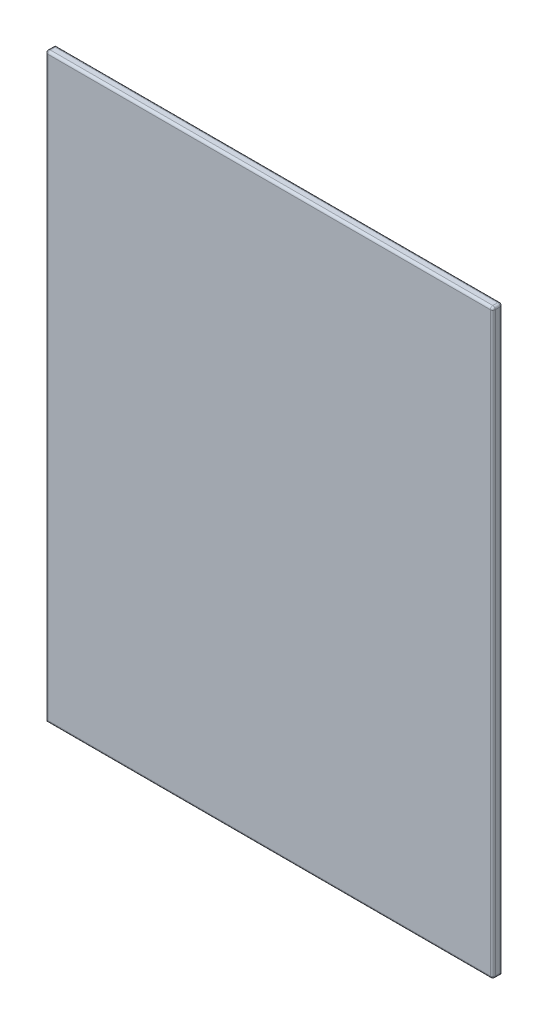
ISO-10303-21;
HEADER;
FILE_DESCRIPTION(('STEP AP214'),'2;1');
FILE_NAME('part.step','',(''),(''),'','','');
FILE_SCHEMA(('AUTOMOTIVE_DESIGN { 1 0 10303 214 1 1 1 1 }'));
ENDSEC;
DATA;
#1=APPLICATION_CONTEXT('core data for automotive mechanical design processes');
#2=APPLICATION_PROTOCOL_DEFINITION('international standard','automotive_design',2000,#1);
#3=PRODUCT_CONTEXT('',#1,'mechanical');
#4=PRODUCT('Part','Part','',(#3));
#5=PRODUCT_RELATED_PRODUCT_CATEGORY('part','',(#4));
#6=PRODUCT_DEFINITION_FORMATION('','',#4);
#7=PRODUCT_DEFINITION_CONTEXT('part definition',#1,'design');
#8=PRODUCT_DEFINITION('design','',#6,#7);
#9=PRODUCT_DEFINITION_SHAPE('','',#8);
#10=(LENGTH_UNIT() NAMED_UNIT(*) SI_UNIT(.MILLI.,.METRE.));
#11=(NAMED_UNIT(*) PLANE_ANGLE_UNIT() SI_UNIT($,.RADIAN.));
#12=(NAMED_UNIT(*) SI_UNIT($,.STERADIAN.) SOLID_ANGLE_UNIT());
#13=UNCERTAINTY_MEASURE_WITH_UNIT(LENGTH_MEASURE(1.E-05),#10,'distance_accuracy_value','');
#14=(GEOMETRIC_REPRESENTATION_CONTEXT(3) GLOBAL_UNCERTAINTY_ASSIGNED_CONTEXT((#13)) GLOBAL_UNIT_ASSIGNED_CONTEXT((#10,
#11,#12)) REPRESENTATION_CONTEXT('',''));
#15=CARTESIAN_POINT('',(0.,0.,0.));
#16=DIRECTION('',(0.,0.,1.));
#17=DIRECTION('',(1.,0.,0.));
#18=AXIS2_PLACEMENT_3D('',#15,#16,#17);
#19=CARTESIAN_POINT('',(457.5,595.,20.));
#20=DIRECTION('',(-1.,0.,0.));
#21=DIRECTION('',(0.,-1.,0.));
#22=AXIS2_PLACEMENT_3D('',#19,#20,#21);
#23=PLANE('',#22);
#24=DIRECTION('',(0.,1.,0.));
#25=VECTOR('',#24,1.);
#26=CARTESIAN_POINT('',(457.5,-595.,15.));
#27=LINE('',#26,#25);
#28=CARTESIAN_POINT('',(457.5,590.,15.));
#29=VERTEX_POINT('',#28);
#30=CARTESIAN_POINT('',(457.5,-590.,15.));
#31=VERTEX_POINT('',#30);
#32=EDGE_CURVE('E139',#29,#31,#27,.F.);
#33=ORIENTED_EDGE('',*,*,#32,.T.);
#34=DIRECTION('',(0.,0.,-1.));
#35=VECTOR('',#34,1.);
#36=CARTESIAN_POINT('',(457.5,-590.,20.));
#37=LINE('',#36,#35);
#38=CARTESIAN_POINT('',(457.5,-590.,5.));
#39=VERTEX_POINT('',#38);
#40=EDGE_CURVE('E146',#31,#39,#37,.T.);
#41=ORIENTED_EDGE('',*,*,#40,.T.);
#42=DIRECTION('',(0.,1.,0.));
#43=VECTOR('',#42,1.);
#44=CARTESIAN_POINT('',(457.5,595.,5.));
#45=LINE('',#44,#43);
#46=CARTESIAN_POINT('',(457.5,590.,5.));
#47=VERTEX_POINT('',#46);
#48=EDGE_CURVE('E142',#39,#47,#45,.T.);
#49=ORIENTED_EDGE('',*,*,#48,.T.);
#50=DIRECTION('',(0.,0.,-1.));
#51=VECTOR('',#50,1.);
#52=CARTESIAN_POINT('',(457.5,590.,20.));
#53=LINE('',#52,#51);
#54=EDGE_CURVE('E119',#47,#29,#53,.F.);
#55=ORIENTED_EDGE('',*,*,#54,.T.);
#56=EDGE_LOOP('',(#33,#41,#49,#55));
#57=FACE_BOUND('',#56,.T.);
#58=ADVANCED_FACE('F39',(#57),#23,.F.);
#59=CARTESIAN_POINT('',(-457.5,595.,20.));
#60=DIRECTION('',(0.,-1.,0.));
#61=DIRECTION('',(0.,0.,-1.));
#62=AXIS2_PLACEMENT_3D('',#59,#60,#61);
#63=PLANE('',#62);
#64=DIRECTION('',(-1.,0.,0.));
#65=VECTOR('',#64,1.);
#66=CARTESIAN_POINT('',(-457.5,595.,5.));
#67=LINE('',#66,#65);
#68=CARTESIAN_POINT('',(452.5,595.,5.));
#69=VERTEX_POINT('',#68);
#70=CARTESIAN_POINT('',(-452.5,595.,5.));
#71=VERTEX_POINT('',#70);
#72=EDGE_CURVE('E160',#69,#71,#67,.T.);
#73=ORIENTED_EDGE('',*,*,#72,.T.);
#74=DIRECTION('',(0.,0.,-1.));
#75=VECTOR('',#74,1.);
#76=CARTESIAN_POINT('',(-452.5,595.,20.));
#77=LINE('',#76,#75);
#78=CARTESIAN_POINT('',(-452.5,595.,15.));
#79=VERTEX_POINT('',#78);
#80=EDGE_CURVE('E164',#71,#79,#77,.F.);
#81=ORIENTED_EDGE('',*,*,#80,.T.);
#82=DIRECTION('',(-1.,0.,0.));
#83=VECTOR('',#82,1.);
#84=CARTESIAN_POINT('',(457.5,595.,15.));
#85=LINE('',#84,#83);
#86=CARTESIAN_POINT('',(452.5,595.,15.));
#87=VERTEX_POINT('',#86);
#88=EDGE_CURVE('E157',#79,#87,#85,.F.);
#89=ORIENTED_EDGE('',*,*,#88,.T.);
#90=DIRECTION('',(0.,0.,-1.));
#91=VECTOR('',#90,1.);
#92=CARTESIAN_POINT('',(452.5,595.,20.));
#93=LINE('',#92,#91);
#94=EDGE_CURVE('E154',#87,#69,#93,.T.);
#95=ORIENTED_EDGE('',*,*,#94,.T.);
#96=EDGE_LOOP('',(#73,#81,#89,#95));
#97=FACE_BOUND('',#96,.T.);
#98=ADVANCED_FACE('F291',(#97),#63,.F.);
#99=CARTESIAN_POINT('',(-457.5,595.,20.));
#100=DIRECTION('',(1.,0.,0.));
#101=DIRECTION('',(0.,1.,0.));
#102=AXIS2_PLACEMENT_3D('',#99,#100,#101);
#103=PLANE('',#102);
#104=DIRECTION('',(0.,0.,-1.));
#105=VECTOR('',#104,1.);
#106=CARTESIAN_POINT('',(-457.5,-595.,20.));
#107=LINE('',#106,#105);
#108=CARTESIAN_POINT('',(-457.5,-595.,15.));
#109=VERTEX_POINT('',#108);
#110=CARTESIAN_POINT('',(-457.5,-595.,0.));
#111=VERTEX_POINT('',#110);
#112=EDGE_CURVE('E113',#109,#111,#107,.T.);
#113=ORIENTED_EDGE('',*,*,#112,.F.);
#114=DIRECTION('',(0.,-1.,0.));
#115=VECTOR('',#114,1.);
#116=CARTESIAN_POINT('',(-457.5,595.,15.));
#117=LINE('',#116,#115);
#118=CARTESIAN_POINT('',(-457.5,590.,15.));
#119=VERTEX_POINT('',#118);
#120=EDGE_CURVE('E63',#109,#119,#117,.F.);
#121=ORIENTED_EDGE('',*,*,#120,.T.);
#122=DIRECTION('',(0.,0.,-1.));
#123=VECTOR('',#122,1.);
#124=CARTESIAN_POINT('',(-457.5,590.,20.));
#125=LINE('',#124,#123);
#126=CARTESIAN_POINT('',(-457.5,590.,0.));
#127=VERTEX_POINT('',#126);
#128=EDGE_CURVE('E125',#119,#127,#125,.T.);
#129=ORIENTED_EDGE('',*,*,#128,.T.);
#130=DIRECTION('',(0.,-1.,0.));
#131=VECTOR('',#130,1.);
#132=CARTESIAN_POINT('',(-457.5,595.,0.));
#133=LINE('',#132,#131);
#134=EDGE_CURVE('E122',#127,#111,#133,.T.);
#135=ORIENTED_EDGE('',*,*,#134,.T.);
#136=EDGE_LOOP('',(#113,#121,#129,#135));
#137=FACE_BOUND('',#136,.T.);
#138=ADVANCED_FACE('F123',(#137),#103,.F.);
#139=CARTESIAN_POINT('',(-457.5,-595.,20.));
#140=DIRECTION('',(0.,1.,0.));
#141=DIRECTION('',(0.,0.,1.));
#142=AXIS2_PLACEMENT_3D('',#139,#140,#141);
#143=PLANE('',#142);
#144=DIRECTION('',(0.,0.,-1.));
#145=VECTOR('',#144,1.);
#146=CARTESIAN_POINT('',(452.5,-595.,20.));
#147=LINE('',#146,#145);
#148=CARTESIAN_POINT('',(452.5,-595.,0.));
#149=VERTEX_POINT('',#148);
#150=CARTESIAN_POINT('',(452.5,-595.,15.));
#151=VERTEX_POINT('',#150);
#152=EDGE_CURVE('E49',#149,#151,#147,.F.);
#153=ORIENTED_EDGE('',*,*,#152,.T.);
#154=DIRECTION('',(1.,0.,0.));
#155=VECTOR('',#154,1.);
#156=CARTESIAN_POINT('',(-457.5,-595.,15.));
#157=LINE('',#156,#155);
#158=EDGE_CURVE('E11',#151,#109,#157,.F.);
#159=ORIENTED_EDGE('',*,*,#158,.T.);
#160=ORIENTED_EDGE('',*,*,#112,.T.);
#161=DIRECTION('',(1.,0.,0.));
#162=VECTOR('',#161,1.);
#163=CARTESIAN_POINT('',(-457.5,-595.,0.));
#164=LINE('',#163,#162);
#165=EDGE_CURVE('E117',#111,#149,#164,.T.);
#166=ORIENTED_EDGE('',*,*,#165,.T.);
#167=EDGE_LOOP('',(#153,#159,#160,#166));
#168=FACE_BOUND('',#167,.T.);
#169=ADVANCED_FACE('F115',(#168),#143,.F.);
#170=CARTESIAN_POINT('',(0.,0.,20.));
#171=DIRECTION('',(0.,0.,1.));
#172=DIRECTION('',(1.,0.,0.));
#173=AXIS2_PLACEMENT_3D('',#170,#171,#172);
#174=PLANE('',#173);
#175=DIRECTION('',(1.,0.,0.));
#176=VECTOR('',#175,1.);
#177=CARTESIAN_POINT('',(457.5,-590.,20.));
#178=LINE('',#177,#176);
#179=CARTESIAN_POINT('',(-452.5,-590.,20.));
#180=VERTEX_POINT('',#179);
#181=CARTESIAN_POINT('',(452.5,-590.,20.));
#182=VERTEX_POINT('',#181);
#183=EDGE_CURVE('E167',#180,#182,#178,.T.);
#184=ORIENTED_EDGE('',*,*,#183,.T.);
#185=DIRECTION('',(0.,1.,0.));
#186=VECTOR('',#185,1.);
#187=CARTESIAN_POINT('',(452.5,595.,20.));
#188=LINE('',#187,#186);
#189=CARTESIAN_POINT('',(452.5,590.,20.));
#190=VERTEX_POINT('',#189);
#191=EDGE_CURVE('E176',#182,#190,#188,.T.);
#192=ORIENTED_EDGE('',*,*,#191,.T.);
#193=DIRECTION('',(-1.,0.,0.));
#194=VECTOR('',#193,1.);
#195=CARTESIAN_POINT('',(-457.5,590.,20.));
#196=LINE('',#195,#194);
#197=CARTESIAN_POINT('',(-452.5,590.,20.));
#198=VERTEX_POINT('',#197);
#199=EDGE_CURVE('E173',#190,#198,#196,.T.);
#200=ORIENTED_EDGE('',*,*,#199,.T.);
#201=DIRECTION('',(0.,-1.,0.));
#202=VECTOR('',#201,1.);
#203=CARTESIAN_POINT('',(-452.5,-595.,20.));
#204=LINE('',#203,#202);
#205=EDGE_CURVE('E170',#198,#180,#204,.T.);
#206=ORIENTED_EDGE('',*,*,#205,.T.);
#207=EDGE_LOOP('',(#184,#192,#200,#206));
#208=FACE_BOUND('',#207,.T.);
#209=ADVANCED_FACE('F283',(#208),#174,.T.);
#210=CARTESIAN_POINT('',(0.,0.,0.));
#211=DIRECTION('',(0.,0.,1.));
#212=DIRECTION('',(1.,0.,0.));
#213=AXIS2_PLACEMENT_3D('',#210,#211,#212);
#214=PLANE('',#213);
#215=DIRECTION('',(-1.,0.,0.));
#216=VECTOR('',#215,1.);
#217=CARTESIAN_POINT('',(0.,590.,0.));
#218=LINE('',#217,#216);
#219=CARTESIAN_POINT('',(452.5,590.,0.));
#220=VERTEX_POINT('',#219);
#221=EDGE_CURVE('E149',#127,#220,#218,.F.);
#222=ORIENTED_EDGE('',*,*,#221,.T.);
#223=DIRECTION('',(0.,1.,0.));
#224=VECTOR('',#223,1.);
#225=CARTESIAN_POINT('',(452.5,0.,0.));
#226=LINE('',#225,#224);
#227=EDGE_CURVE('E133',#220,#149,#226,.F.);
#228=ORIENTED_EDGE('',*,*,#227,.T.);
#229=ORIENTED_EDGE('',*,*,#165,.F.);
#230=ORIENTED_EDGE('',*,*,#134,.F.);
#231=EDGE_LOOP('',(#222,#228,#229,#230));
#232=FACE_BOUND('',#231,.T.);
#233=ADVANCED_FACE('F131',(#232),#214,.F.);
#234=CARTESIAN_POINT('',(-452.5,0.,15.));
#235=DIRECTION('',(0.,1.,0.));
#236=DIRECTION('',(-1.,0.,0.));
#237=AXIS2_PLACEMENT_3D('',#234,#235,#236);
#238=CYLINDRICAL_SURFACE('',#237,5.);
#239=CARTESIAN_POINT('',(-452.5,-590.,15.));
#240=DIRECTION('',(-0.707106781186548,0.707106781186547,0.));
#241=DIRECTION('',(-0.707106781186547,-0.707106781186548,0.));
#242=AXIS2_PLACEMENT_3D('',#239,#240,#241);
#243=ELLIPSE('',#242,7.07106781186547,5.);
#244=EDGE_CURVE('E230',#180,#109,#243,.F.);
#245=ORIENTED_EDGE('',*,*,#244,.F.);
#246=ORIENTED_EDGE('',*,*,#205,.F.);
#247=CARTESIAN_POINT('',(-452.5,590.,15.));
#248=DIRECTION('',(0.,1.,0.));
#249=DIRECTION('',(0.,0.,1.));
#250=AXIS2_PLACEMENT_3D('',#247,#248,#249);
#251=CIRCLE('',#250,5.);
#252=EDGE_CURVE('E233',#119,#198,#251,.T.);
#253=ORIENTED_EDGE('',*,*,#252,.F.);
#254=ORIENTED_EDGE('',*,*,#120,.F.);
#255=EDGE_LOOP('',(#245,#246,#253,#254));
#256=FACE_BOUND('',#255,.T.);
#257=ADVANCED_FACE('F41',(#256),#238,.T.);
#258=CARTESIAN_POINT('',(0.,590.,15.));
#259=DIRECTION('',(1.,0.,0.));
#260=DIRECTION('',(0.,0.,-1.));
#261=AXIS2_PLACEMENT_3D('',#258,#259,#260);
#262=CYLINDRICAL_SURFACE('',#261,5.);
#263=CARTESIAN_POINT('',(-452.5,590.,15.));
#264=DIRECTION('',(-1.,0.,0.));
#265=DIRECTION('',(0.,-1.,0.));
#266=AXIS2_PLACEMENT_3D('',#263,#264,#265);
#267=CIRCLE('',#266,5.);
#268=EDGE_CURVE('E43',#198,#79,#267,.T.);
#269=ORIENTED_EDGE('',*,*,#268,.F.);
#270=ORIENTED_EDGE('',*,*,#199,.F.);
#271=CARTESIAN_POINT('',(452.5,590.,15.));
#272=DIRECTION('',(1.,0.,0.));
#273=DIRECTION('',(0.,0.,-1.));
#274=AXIS2_PLACEMENT_3D('',#271,#272,#273);
#275=CIRCLE('',#274,5.);
#276=EDGE_CURVE('E223',#87,#190,#275,.T.);
#277=ORIENTED_EDGE('',*,*,#276,.F.);
#278=ORIENTED_EDGE('',*,*,#88,.F.);
#279=EDGE_LOOP('',(#269,#270,#277,#278));
#280=FACE_BOUND('',#279,.T.);
#281=ADVANCED_FACE('F286',(#280),#262,.T.);
#282=CARTESIAN_POINT('',(-452.5,590.,15.));
#283=DIRECTION('',(0.,0.,1.));
#284=DIRECTION('',(1.,0.,0.));
#285=AXIS2_PLACEMENT_3D('',#282,#283,#284);
#286=SPHERICAL_SURFACE('',#285,5.);
#287=ORIENTED_EDGE('',*,*,#252,.T.);
#288=ORIENTED_EDGE('',*,*,#268,.T.);
#289=CARTESIAN_POINT('',(-452.5,590.,15.));
#290=DIRECTION('',(0.,0.,1.));
#291=DIRECTION('',(1.,0.,0.));
#292=AXIS2_PLACEMENT_3D('',#289,#290,#291);
#293=CIRCLE('',#292,5.);
#294=EDGE_CURVE('E219',#119,#79,#293,.F.);
#295=ORIENTED_EDGE('',*,*,#294,.F.);
#296=EDGE_LOOP('',(#287,#288,#295));
#297=FACE_BOUND('',#296,.T.);
#298=ADVANCED_FACE('F241',(#297),#286,.T.);
#299=CARTESIAN_POINT('',(0.,-590.,15.));
#300=DIRECTION('',(-1.,0.,0.));
#301=DIRECTION('',(0.,0.,1.));
#302=AXIS2_PLACEMENT_3D('',#299,#300,#301);
#303=CYLINDRICAL_SURFACE('',#302,5.);
#304=ORIENTED_EDGE('',*,*,#244,.T.);
#305=ORIENTED_EDGE('',*,*,#158,.F.);
#306=CARTESIAN_POINT('',(452.5,-590.,15.));
#307=DIRECTION('',(1.,0.,0.));
#308=DIRECTION('',(0.,0.,-1.));
#309=AXIS2_PLACEMENT_3D('',#306,#307,#308);
#310=CIRCLE('',#309,5.);
#311=EDGE_CURVE('E215',#182,#151,#310,.T.);
#312=ORIENTED_EDGE('',*,*,#311,.F.);
#313=ORIENTED_EDGE('',*,*,#183,.F.);
#314=EDGE_LOOP('',(#304,#305,#312,#313));
#315=FACE_BOUND('',#314,.T.);
#316=ADVANCED_FACE('F278',(#315),#303,.T.);
#317=CARTESIAN_POINT('',(452.5,0.,15.));
#318=DIRECTION('',(0.,-1.,0.));
#319=DIRECTION('',(1.,0.,0.));
#320=AXIS2_PLACEMENT_3D('',#317,#318,#319);
#321=CYLINDRICAL_SURFACE('',#320,5.);
#322=CARTESIAN_POINT('',(452.5,590.,15.));
#323=DIRECTION('',(0.,1.,0.));
#324=DIRECTION('',(0.,0.,1.));
#325=AXIS2_PLACEMENT_3D('',#322,#323,#324);
#326=CIRCLE('',#325,5.);
#327=EDGE_CURVE('E226',#190,#29,#326,.T.);
#328=ORIENTED_EDGE('',*,*,#327,.F.);
#329=ORIENTED_EDGE('',*,*,#191,.F.);
#330=CARTESIAN_POINT('',(452.5,-590.,15.));
#331=DIRECTION('',(0.,-1.,0.));
#332=DIRECTION('',(0.,0.,-1.));
#333=AXIS2_PLACEMENT_3D('',#330,#331,#332);
#334=CIRCLE('',#333,5.);
#335=EDGE_CURVE('E211',#31,#182,#334,.T.);
#336=ORIENTED_EDGE('',*,*,#335,.F.);
#337=ORIENTED_EDGE('',*,*,#32,.F.);
#338=EDGE_LOOP('',(#328,#329,#336,#337));
#339=FACE_BOUND('',#338,.T.);
#340=ADVANCED_FACE('F318',(#339),#321,.T.);
#341=CARTESIAN_POINT('',(452.5,590.,15.));
#342=DIRECTION('',(0.,0.,1.));
#343=DIRECTION('',(1.,0.,0.));
#344=AXIS2_PLACEMENT_3D('',#341,#342,#343);
#345=SPHERICAL_SURFACE('',#344,5.);
#346=ORIENTED_EDGE('',*,*,#276,.T.);
#347=ORIENTED_EDGE('',*,*,#327,.T.);
#348=CARTESIAN_POINT('',(452.5,590.,15.));
#349=DIRECTION('',(0.,0.,1.));
#350=DIRECTION('',(1.,0.,0.));
#351=AXIS2_PLACEMENT_3D('',#348,#349,#350);
#352=CIRCLE('',#351,5.);
#353=EDGE_CURVE('E207',#87,#29,#352,.F.);
#354=ORIENTED_EDGE('',*,*,#353,.F.);
#355=EDGE_LOOP('',(#346,#347,#354));
#356=FACE_BOUND('',#355,.T.);
#357=ADVANCED_FACE('F289',(#356),#345,.T.);
#358=CARTESIAN_POINT('',(-452.5,590.,20.));
#359=DIRECTION('',(0.,0.,-1.));
#360=DIRECTION('',(-1.,0.,0.));
#361=AXIS2_PLACEMENT_3D('',#358,#359,#360);
#362=CYLINDRICAL_SURFACE('',#361,5.);
#363=ORIENTED_EDGE('',*,*,#294,.T.);
#364=ORIENTED_EDGE('',*,*,#80,.F.);
#365=CARTESIAN_POINT('',(-452.5,590.,5.));
#366=DIRECTION('',(0.707106781186547,0.,-0.707106781186547));
#367=DIRECTION('',(-0.707106781186547,0.,-0.707106781186547));
#368=AXIS2_PLACEMENT_3D('',#365,#366,#367);
#369=ELLIPSE('',#368,7.07106781186547,5.);
#370=EDGE_CURVE('E204',#127,#71,#369,.T.);
#371=ORIENTED_EDGE('',*,*,#370,.F.);
#372=ORIENTED_EDGE('',*,*,#128,.F.);
#373=EDGE_LOOP('',(#363,#364,#371,#372));
#374=FACE_BOUND('',#373,.T.);
#375=ADVANCED_FACE('F247',(#374),#362,.T.);
#376=CARTESIAN_POINT('',(452.5,-590.,15.));
#377=DIRECTION('',(0.,0.,1.));
#378=DIRECTION('',(1.,0.,0.));
#379=AXIS2_PLACEMENT_3D('',#376,#377,#378);
#380=SPHERICAL_SURFACE('',#379,5.);
#381=ORIENTED_EDGE('',*,*,#335,.T.);
#382=ORIENTED_EDGE('',*,*,#311,.T.);
#383=CARTESIAN_POINT('',(452.5,-590.,15.));
#384=DIRECTION('',(0.,0.,1.));
#385=DIRECTION('',(1.,0.,0.));
#386=AXIS2_PLACEMENT_3D('',#383,#384,#385);
#387=CIRCLE('',#386,5.);
#388=EDGE_CURVE('E200',#31,#151,#387,.F.);
#389=ORIENTED_EDGE('',*,*,#388,.F.);
#390=EDGE_LOOP('',(#381,#382,#389));
#391=FACE_BOUND('',#390,.T.);
#392=ADVANCED_FACE('F274',(#391),#380,.T.);
#393=CARTESIAN_POINT('',(452.5,590.,20.));
#394=DIRECTION('',(0.,0.,-1.));
#395=DIRECTION('',(-1.,0.,0.));
#396=AXIS2_PLACEMENT_3D('',#393,#394,#395);
#397=CYLINDRICAL_SURFACE('',#396,5.);
#398=ORIENTED_EDGE('',*,*,#353,.T.);
#399=ORIENTED_EDGE('',*,*,#54,.F.);
#400=CARTESIAN_POINT('',(452.5,590.,5.));
#401=DIRECTION('',(0.,0.,-1.));
#402=DIRECTION('',(-1.,0.,0.));
#403=AXIS2_PLACEMENT_3D('',#400,#401,#402);
#404=CIRCLE('',#403,5.);
#405=EDGE_CURVE('E196',#69,#47,#404,.T.);
#406=ORIENTED_EDGE('',*,*,#405,.F.);
#407=ORIENTED_EDGE('',*,*,#94,.F.);
#408=EDGE_LOOP('',(#398,#399,#406,#407));
#409=FACE_BOUND('',#408,.T.);
#410=ADVANCED_FACE('F264',(#409),#397,.T.);
#411=CARTESIAN_POINT('',(-457.5,590.,5.));
#412=DIRECTION('',(-1.,0.,0.));
#413=DIRECTION('',(0.,0.,1.));
#414=AXIS2_PLACEMENT_3D('',#411,#412,#413);
#415=CYLINDRICAL_SURFACE('',#414,5.);
#416=ORIENTED_EDGE('',*,*,#370,.T.);
#417=ORIENTED_EDGE('',*,*,#72,.F.);
#418=CARTESIAN_POINT('',(452.5,590.,5.));
#419=DIRECTION('',(1.,0.,0.));
#420=DIRECTION('',(0.,0.,-1.));
#421=AXIS2_PLACEMENT_3D('',#418,#419,#420);
#422=CIRCLE('',#421,5.);
#423=EDGE_CURVE('E192',#220,#69,#422,.T.);
#424=ORIENTED_EDGE('',*,*,#423,.F.);
#425=ORIENTED_EDGE('',*,*,#221,.F.);
#426=EDGE_LOOP('',(#416,#417,#424,#425));
#427=FACE_BOUND('',#426,.T.);
#428=ADVANCED_FACE('F252',(#427),#415,.T.);
#429=CARTESIAN_POINT('',(452.5,-590.,20.));
#430=DIRECTION('',(0.,0.,-1.));
#431=DIRECTION('',(-1.,0.,0.));
#432=AXIS2_PLACEMENT_3D('',#429,#430,#431);
#433=CYLINDRICAL_SURFACE('',#432,5.);
#434=ORIENTED_EDGE('',*,*,#388,.T.);
#435=ORIENTED_EDGE('',*,*,#152,.F.);
#436=CARTESIAN_POINT('',(452.5,-590.,5.));
#437=DIRECTION('',(0.,0.707106781186547,-0.707106781186547));
#438=DIRECTION('',(0.,-0.707106781186547,-0.707106781186547));
#439=AXIS2_PLACEMENT_3D('',#436,#437,#438);
#440=ELLIPSE('',#439,7.07106781186547,5.);
#441=EDGE_CURVE('E189',#39,#149,#440,.T.);
#442=ORIENTED_EDGE('',*,*,#441,.F.);
#443=ORIENTED_EDGE('',*,*,#40,.F.);
#444=EDGE_LOOP('',(#434,#435,#442,#443));
#445=FACE_BOUND('',#444,.T.);
#446=ADVANCED_FACE('F271',(#445),#433,.T.);
#447=CARTESIAN_POINT('',(452.5,590.,5.));
#448=DIRECTION('',(0.,1.,0.));
#449=DIRECTION('',(0.,0.,1.));
#450=AXIS2_PLACEMENT_3D('',#447,#448,#449);
#451=SPHERICAL_SURFACE('',#450,5.);
#452=ORIENTED_EDGE('',*,*,#423,.T.);
#453=ORIENTED_EDGE('',*,*,#405,.T.);
#454=CARTESIAN_POINT('',(452.5,590.,5.));
#455=DIRECTION('',(0.,1.,0.));
#456=DIRECTION('',(0.,0.,1.));
#457=AXIS2_PLACEMENT_3D('',#454,#455,#456);
#458=CIRCLE('',#457,5.);
#459=EDGE_CURVE('E186',#220,#47,#458,.F.);
#460=ORIENTED_EDGE('',*,*,#459,.F.);
#461=EDGE_LOOP('',(#452,#453,#460));
#462=FACE_BOUND('',#461,.T.);
#463=ADVANCED_FACE('F260',(#462),#451,.T.);
#464=CARTESIAN_POINT('',(452.5,595.,5.));
#465=DIRECTION('',(0.,1.,0.));
#466=DIRECTION('',(-1.,0.,0.));
#467=AXIS2_PLACEMENT_3D('',#464,#465,#466);
#468=CYLINDRICAL_SURFACE('',#467,5.);
#469=ORIENTED_EDGE('',*,*,#441,.T.);
#470=ORIENTED_EDGE('',*,*,#227,.F.);
#471=ORIENTED_EDGE('',*,*,#459,.T.);
#472=ORIENTED_EDGE('',*,*,#48,.F.);
#473=EDGE_LOOP('',(#469,#470,#471,#472));
#474=FACE_BOUND('',#473,.T.);
#475=ADVANCED_FACE('F257',(#474),#468,.T.);
#476=CLOSED_SHELL('',(#58,#98,#138,#169,#209,#233,#257,#281,#298,#316,#340,#357,#375,#392,#410,
#428,#446,#463,#475));
#477=MANIFOLD_SOLID_BREP('B2',#476);
#478=ADVANCED_BREP_SHAPE_REPRESENTATION('',(#18,#477),#14);
#479=SHAPE_DEFINITION_REPRESENTATION(#9,#478);
ENDSEC;
END-ISO-10303-21;
